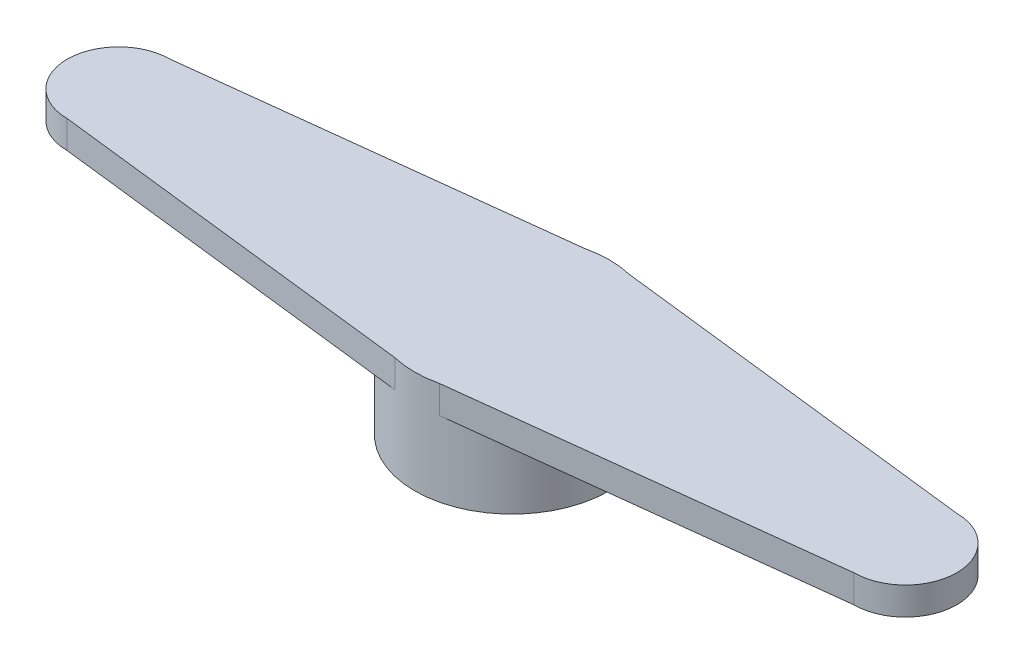
ISO-10303-21;
HEADER;
FILE_DESCRIPTION(('STEP AP214'),'2;1');
FILE_NAME('part.step','',(''),(''),'','','');
FILE_SCHEMA(('AUTOMOTIVE_DESIGN { 1 0 10303 214 1 1 1 1 }'));
ENDSEC;
DATA;
#1=APPLICATION_CONTEXT('core data for automotive mechanical design processes');
#2=APPLICATION_PROTOCOL_DEFINITION('international standard','automotive_design',2000,#1);
#3=PRODUCT_CONTEXT('',#1,'mechanical');
#4=PRODUCT('Part','Part','',(#3));
#5=PRODUCT_RELATED_PRODUCT_CATEGORY('part','',(#4));
#6=PRODUCT_DEFINITION_FORMATION('','',#4);
#7=PRODUCT_DEFINITION_CONTEXT('part definition',#1,'design');
#8=PRODUCT_DEFINITION('design','',#6,#7);
#9=PRODUCT_DEFINITION_SHAPE('','',#8);
#10=(LENGTH_UNIT() NAMED_UNIT(*) SI_UNIT(.MILLI.,.METRE.));
#11=(NAMED_UNIT(*) PLANE_ANGLE_UNIT() SI_UNIT($,.RADIAN.));
#12=(NAMED_UNIT(*) SI_UNIT($,.STERADIAN.) SOLID_ANGLE_UNIT());
#13=UNCERTAINTY_MEASURE_WITH_UNIT(LENGTH_MEASURE(1.E-05),#10,'distance_accuracy_value','');
#14=(GEOMETRIC_REPRESENTATION_CONTEXT(3) GLOBAL_UNCERTAINTY_ASSIGNED_CONTEXT((#13)) GLOBAL_UNIT_ASSIGNED_CONTEXT((#10,
#11,#12)) REPRESENTATION_CONTEXT('',''));
#15=CARTESIAN_POINT('',(0.,0.,0.));
#16=DIRECTION('',(0.,0.,1.));
#17=DIRECTION('',(1.,0.,0.));
#18=AXIS2_PLACEMENT_3D('',#15,#16,#17);
#19=CARTESIAN_POINT('',(0.,3.7,0.));
#20=DIRECTION('',(0.,-1.,0.));
#21=DIRECTION('',(0.,0.,-1.));
#22=AXIS2_PLACEMENT_3D('',#19,#20,#21);
#23=CYLINDRICAL_SURFACE('',#22,2.5);
#24=CARTESIAN_POINT('',(0.,0.,0.));
#25=DIRECTION('',(0.,1.,0.));
#26=DIRECTION('',(0.,0.,1.));
#27=AXIS2_PLACEMENT_3D('',#24,#25,#26);
#28=CIRCLE('',#27,2.5);
#29=CARTESIAN_POINT('',(0.,0.,2.5));
#30=VERTEX_POINT('',#29);
#31=EDGE_CURVE('E157',#30,#30,#28,.T.);
#32=ORIENTED_EDGE('',*,*,#31,.F.);
#33=EDGE_LOOP('',(#32));
#34=FACE_BOUND('',#33,.T.);
#35=CARTESIAN_POINT('',(0.,2.7,0.));
#36=DIRECTION('',(0.,1.,0.));
#37=DIRECTION('',(0.,0.,1.));
#38=AXIS2_PLACEMENT_3D('',#35,#36,#37);
#39=CIRCLE('',#38,2.5);
#40=CARTESIAN_POINT('',(0.,2.7,2.5));
#41=VERTEX_POINT('',#40);
#42=EDGE_CURVE('E150',#41,#41,#39,.T.);
#43=ORIENTED_EDGE('',*,*,#42,.T.);
#44=EDGE_LOOP('',(#43));
#45=FACE_BOUND('',#44,.T.);
#46=ADVANCED_FACE('F35',(#34,#45),#23,.F.);
#47=CARTESIAN_POINT('',(0.,3.7,0.));
#48=DIRECTION('',(0.,1.,0.));
#49=DIRECTION('',(0.,0.,1.));
#50=AXIS2_PLACEMENT_3D('',#47,#48,#49);
#51=PLANE('',#50);
#52=DIRECTION('',(0.993269870354682,0.,0.115822988415917));
#53=VECTOR('',#52,1.);
#54=CARTESIAN_POINT('',(0.,3.7,3.5));
#55=LINE('',#54,#53);
#56=CARTESIAN_POINT('',(-14.15,3.7,1.85));
#57=VERTEX_POINT('',#56);
#58=CARTESIAN_POINT('',(-0.805304392815789,3.7,3.40609524748084));
#59=VERTEX_POINT('',#58);
#60=EDGE_CURVE('E108',#57,#59,#55,.T.);
#61=ORIENTED_EDGE('',*,*,#60,.T.);
#62=CARTESIAN_POINT('',(0.,3.7,0.));
#63=DIRECTION('',(0.,1.,0.));
#64=DIRECTION('',(0.,0.,1.));
#65=AXIS2_PLACEMENT_3D('',#62,#63,#64);
#66=CIRCLE('',#65,3.5);
#67=CARTESIAN_POINT('',(0.805304392815791,3.7,3.40609524748084));
#68=VERTEX_POINT('',#67);
#69=EDGE_CURVE('E50',#59,#68,#66,.T.);
#70=ORIENTED_EDGE('',*,*,#69,.T.);
#71=DIRECTION('',(0.993269870354682,0.,-0.115822988415917));
#72=VECTOR('',#71,1.);
#73=CARTESIAN_POINT('',(14.15,3.7,1.85));
#74=LINE('',#73,#72);
#75=CARTESIAN_POINT('',(14.15,3.7,1.85));
#76=VERTEX_POINT('',#75);
#77=EDGE_CURVE('E144',#68,#76,#74,.T.);
#78=ORIENTED_EDGE('',*,*,#77,.T.);
#79=CARTESIAN_POINT('',(14.15,3.7,0.));
#80=DIRECTION('',(0.,1.,0.));
#81=DIRECTION('',(0.,0.,1.));
#82=AXIS2_PLACEMENT_3D('',#79,#80,#81);
#83=CIRCLE('',#82,1.85);
#84=CARTESIAN_POINT('',(14.15,3.7,-1.85));
#85=VERTEX_POINT('',#84);
#86=EDGE_CURVE('E146',#76,#85,#83,.T.);
#87=ORIENTED_EDGE('',*,*,#86,.T.);
#88=DIRECTION('',(-0.993269870354682,0.,-0.115822988415917));
#89=VECTOR('',#88,1.);
#90=CARTESIAN_POINT('',(0.,3.7,-3.5));
#91=LINE('',#90,#89);
#92=CARTESIAN_POINT('',(0.805304392815789,3.7,-3.40609524748084));
#93=VERTEX_POINT('',#92);
#94=EDGE_CURVE('E58',#85,#93,#91,.T.);
#95=ORIENTED_EDGE('',*,*,#94,.T.);
#96=CARTESIAN_POINT('',(-0.805304392815791,3.7,-3.40609524748084));
#97=VERTEX_POINT('',#96);
#98=EDGE_CURVE('E163',#93,#97,#66,.T.);
#99=ORIENTED_EDGE('',*,*,#98,.T.);
#100=DIRECTION('',(-0.993269870354682,0.,0.115822988415917));
#101=VECTOR('',#100,1.);
#102=CARTESIAN_POINT('',(-14.15,3.7,-1.85));
#103=LINE('',#102,#101);
#104=CARTESIAN_POINT('',(-14.15,3.7,-1.85));
#105=VERTEX_POINT('',#104);
#106=EDGE_CURVE('E129',#97,#105,#103,.T.);
#107=ORIENTED_EDGE('',*,*,#106,.T.);
#108=CARTESIAN_POINT('',(-14.15,3.7,0.));
#109=DIRECTION('',(0.,1.,0.));
#110=DIRECTION('',(0.,0.,1.));
#111=AXIS2_PLACEMENT_3D('',#108,#109,#110);
#112=CIRCLE('',#111,1.85);
#113=EDGE_CURVE('E141',#105,#57,#112,.T.);
#114=ORIENTED_EDGE('',*,*,#113,.T.);
#115=EDGE_LOOP('',(#61,#70,#78,#87,#95,#99,#107,#114));
#116=FACE_BOUND('',#115,.T.);
#117=ADVANCED_FACE('F175',(#116),#51,.T.);
#118=CARTESIAN_POINT('',(0.,0.,0.));
#119=DIRECTION('',(0.,1.,0.));
#120=DIRECTION('',(0.,0.,1.));
#121=AXIS2_PLACEMENT_3D('',#118,#119,#120);
#122=PLANE('',#121);
#123=CARTESIAN_POINT('',(0.,0.,0.));
#124=DIRECTION('',(0.,1.,0.));
#125=DIRECTION('',(0.,0.,1.));
#126=AXIS2_PLACEMENT_3D('',#123,#124,#125);
#127=CIRCLE('',#126,3.5);
#128=CARTESIAN_POINT('',(0.,0.,3.5));
#129=VERTEX_POINT('',#128);
#130=EDGE_CURVE('E160',#129,#129,#127,.T.);
#131=ORIENTED_EDGE('',*,*,#130,.F.);
#132=EDGE_LOOP('',(#131));
#133=FACE_BOUND('',#132,.T.);
#134=ORIENTED_EDGE('',*,*,#31,.T.);
#135=EDGE_LOOP('',(#134));
#136=FACE_BOUND('',#135,.T.);
#137=ADVANCED_FACE('F198',(#133,#136),#122,.F.);
#138=CARTESIAN_POINT('',(0.,3.7,0.));
#139=DIRECTION('',(0.,-1.,0.));
#140=DIRECTION('',(0.,0.,-1.));
#141=AXIS2_PLACEMENT_3D('',#138,#139,#140);
#142=CYLINDRICAL_SURFACE('',#141,3.5);
#143=DIRECTION('',(0.,-1.,0.));
#144=VECTOR('',#143,1.);
#145=CARTESIAN_POINT('',(-0.805304392815791,3.7,-3.40609524748084));
#146=LINE('',#145,#144);
#147=CARTESIAN_POINT('',(-0.805304392815791,2.7,-3.40609524748084));
#148=VERTEX_POINT('',#147);
#149=EDGE_CURVE('E169',#148,#97,#146,.F.);
#150=ORIENTED_EDGE('',*,*,#149,.T.);
#151=ORIENTED_EDGE('',*,*,#98,.F.);
#152=DIRECTION('',(0.,-1.,0.));
#153=VECTOR('',#152,1.);
#154=CARTESIAN_POINT('',(0.805304392815791,3.7,-3.40609524748084));
#155=LINE('',#154,#153);
#156=CARTESIAN_POINT('',(0.805304392815789,2.7,-3.40609524748084));
#157=VERTEX_POINT('',#156);
#158=EDGE_CURVE('E11',#93,#157,#155,.T.);
#159=ORIENTED_EDGE('',*,*,#158,.T.);
#160=CARTESIAN_POINT('',(0.,2.7,0.));
#161=DIRECTION('',(0.,1.,0.));
#162=DIRECTION('',(0.,0.,1.));
#163=AXIS2_PLACEMENT_3D('',#160,#161,#162);
#164=CIRCLE('',#163,3.5);
#165=CARTESIAN_POINT('',(0.805304392815791,2.7,3.40609524748084));
#166=VERTEX_POINT('',#165);
#167=EDGE_CURVE('E156',#166,#157,#164,.T.);
#168=ORIENTED_EDGE('',*,*,#167,.F.);
#169=DIRECTION('',(0.,-1.,0.));
#170=VECTOR('',#169,1.);
#171=CARTESIAN_POINT('',(0.805304392815791,3.7,3.40609524748084));
#172=LINE('',#171,#170);
#173=EDGE_CURVE('E43',#166,#68,#172,.F.);
#174=ORIENTED_EDGE('',*,*,#173,.T.);
#175=ORIENTED_EDGE('',*,*,#69,.F.);
#176=DIRECTION('',(0.,-1.,0.));
#177=VECTOR('',#176,1.);
#178=CARTESIAN_POINT('',(-0.805304392815791,3.7,3.40609524748084));
#179=LINE('',#178,#177);
#180=CARTESIAN_POINT('',(-0.805304392815789,2.7,3.40609524748084));
#181=VERTEX_POINT('',#180);
#182=EDGE_CURVE('E162',#59,#181,#179,.T.);
#183=ORIENTED_EDGE('',*,*,#182,.T.);
#184=EDGE_CURVE('E122',#148,#181,#164,.T.);
#185=ORIENTED_EDGE('',*,*,#184,.F.);
#186=EDGE_LOOP('',(#150,#151,#159,#168,#174,#175,#183,#185));
#187=FACE_BOUND('',#186,.T.);
#188=ORIENTED_EDGE('',*,*,#130,.T.);
#189=EDGE_LOOP('',(#188));
#190=FACE_BOUND('',#189,.T.);
#191=ADVANCED_FACE('F37',(#187,#190),#142,.T.);
#192=CARTESIAN_POINT('',(-14.15,2.7,0.));
#193=DIRECTION('',(0.,1.,0.));
#194=DIRECTION('',(0.,0.,1.));
#195=AXIS2_PLACEMENT_3D('',#192,#193,#194);
#196=PLANE('',#195);
#197=ORIENTED_EDGE('',*,*,#42,.F.);
#198=EDGE_LOOP('',(#197));
#199=FACE_BOUND('',#198,.T.);
#200=ADVANCED_FACE('F208',(#199),#196,.F.);
#201=CARTESIAN_POINT('',(-14.15,2.7,0.));
#202=DIRECTION('',(0.,1.,0.));
#203=DIRECTION('',(0.,0.,1.));
#204=AXIS2_PLACEMENT_3D('',#201,#202,#203);
#205=CYLINDRICAL_SURFACE('',#204,1.85);
#206=ORIENTED_EDGE('',*,*,#113,.F.);
#207=DIRECTION('',(0.,1.,0.));
#208=VECTOR('',#207,1.);
#209=CARTESIAN_POINT('',(-14.15,2.7,-1.85));
#210=LINE('',#209,#208);
#211=CARTESIAN_POINT('',(-14.15,2.7,-1.85));
#212=VERTEX_POINT('',#211);
#213=EDGE_CURVE('E128',#212,#105,#210,.T.);
#214=ORIENTED_EDGE('',*,*,#213,.F.);
#215=CARTESIAN_POINT('',(-14.15,2.7,0.));
#216=DIRECTION('',(0.,1.,0.));
#217=DIRECTION('',(0.,0.,1.));
#218=AXIS2_PLACEMENT_3D('',#215,#216,#217);
#219=CIRCLE('',#218,1.85);
#220=CARTESIAN_POINT('',(-14.15,2.7,1.85));
#221=VERTEX_POINT('',#220);
#222=EDGE_CURVE('E120',#212,#221,#219,.T.);
#223=ORIENTED_EDGE('',*,*,#222,.T.);
#224=DIRECTION('',(0.,1.,0.));
#225=VECTOR('',#224,1.);
#226=CARTESIAN_POINT('',(-14.15,2.7,1.85));
#227=LINE('',#226,#225);
#228=EDGE_CURVE('E103',#221,#57,#227,.T.);
#229=ORIENTED_EDGE('',*,*,#228,.T.);
#230=EDGE_LOOP('',(#206,#214,#223,#229));
#231=FACE_BOUND('',#230,.T.);
#232=ADVANCED_FACE('F126',(#231),#205,.T.);
#233=DIRECTION('',(-0.993269870354682,0.,0.115822988415917));
#234=VECTOR('',#233,1.);
#235=CARTESIAN_POINT('',(-14.15,2.7,-1.85));
#236=LINE('',#235,#234);
#237=EDGE_CURVE('E114',#148,#212,#236,.T.);
#238=ORIENTED_EDGE('',*,*,#237,.F.);
#239=ORIENTED_EDGE('',*,*,#184,.T.);
#240=DIRECTION('',(0.993269870354682,0.,0.115822988415917));
#241=VECTOR('',#240,1.);
#242=CARTESIAN_POINT('',(0.,2.7,3.5));
#243=LINE('',#242,#241);
#244=EDGE_CURVE('E107',#221,#181,#243,.T.);
#245=ORIENTED_EDGE('',*,*,#244,.F.);
#246=ORIENTED_EDGE('',*,*,#222,.F.);
#247=EDGE_LOOP('',(#238,#239,#245,#246));
#248=FACE_BOUND('',#247,.T.);
#249=ADVANCED_FACE('F119',(#248),#196,.F.);
#250=CARTESIAN_POINT('',(0.,2.7,3.5));
#251=DIRECTION('',(-0.115822988415917,0.,0.993269870354682));
#252=DIRECTION('',(0.993269870354682,0.,0.115822988415917));
#253=AXIS2_PLACEMENT_3D('',#250,#251,#252);
#254=PLANE('',#253);
#255=ORIENTED_EDGE('',*,*,#182,.F.);
#256=ORIENTED_EDGE('',*,*,#60,.F.);
#257=ORIENTED_EDGE('',*,*,#228,.F.);
#258=ORIENTED_EDGE('',*,*,#244,.T.);
#259=EDGE_LOOP('',(#255,#256,#257,#258));
#260=FACE_BOUND('',#259,.T.);
#261=ADVANCED_FACE('F106',(#260),#254,.T.);
#262=CARTESIAN_POINT('',(-14.15,2.7,-1.85));
#263=DIRECTION('',(-0.115822988415917,0.,-0.993269870354682));
#264=DIRECTION('',(-0.993269870354682,0.,0.115822988415917));
#265=AXIS2_PLACEMENT_3D('',#262,#263,#264);
#266=PLANE('',#265);
#267=ORIENTED_EDGE('',*,*,#149,.F.);
#268=ORIENTED_EDGE('',*,*,#237,.T.);
#269=ORIENTED_EDGE('',*,*,#213,.T.);
#270=ORIENTED_EDGE('',*,*,#106,.F.);
#271=EDGE_LOOP('',(#267,#268,#269,#270));
#272=FACE_BOUND('',#271,.T.);
#273=ADVANCED_FACE('F179',(#272),#266,.T.);
#274=CARTESIAN_POINT('',(0.,2.7,-3.5));
#275=DIRECTION('',(0.115822988415917,0.,-0.993269870354682));
#276=DIRECTION('',(-0.993269870354682,0.,-0.115822988415917));
#277=AXIS2_PLACEMENT_3D('',#274,#275,#276);
#278=PLANE('',#277);
#279=ORIENTED_EDGE('',*,*,#158,.F.);
#280=ORIENTED_EDGE('',*,*,#94,.F.);
#281=DIRECTION('',(0.,1.,0.));
#282=VECTOR('',#281,1.);
#283=CARTESIAN_POINT('',(14.15,2.7,-1.85));
#284=LINE('',#283,#282);
#285=CARTESIAN_POINT('',(14.15,2.7,-1.85));
#286=VERTEX_POINT('',#285);
#287=EDGE_CURVE('E151',#286,#85,#284,.T.);
#288=ORIENTED_EDGE('',*,*,#287,.F.);
#289=DIRECTION('',(-0.993269870354682,0.,-0.115822988415917));
#290=VECTOR('',#289,1.);
#291=CARTESIAN_POINT('',(0.,2.7,-3.5));
#292=LINE('',#291,#290);
#293=EDGE_CURVE('E137',#286,#157,#292,.T.);
#294=ORIENTED_EDGE('',*,*,#293,.T.);
#295=EDGE_LOOP('',(#279,#280,#288,#294));
#296=FACE_BOUND('',#295,.T.);
#297=ADVANCED_FACE('F181',(#296),#278,.T.);
#298=CARTESIAN_POINT('',(14.15,2.7,1.85));
#299=DIRECTION('',(0.115822988415917,0.,0.993269870354682));
#300=DIRECTION('',(0.993269870354682,0.,-0.115822988415917));
#301=AXIS2_PLACEMENT_3D('',#298,#299,#300);
#302=PLANE('',#301);
#303=ORIENTED_EDGE('',*,*,#173,.F.);
#304=DIRECTION('',(0.993269870354682,0.,-0.115822988415917));
#305=VECTOR('',#304,1.);
#306=CARTESIAN_POINT('',(14.15,2.7,1.85));
#307=LINE('',#306,#305);
#308=CARTESIAN_POINT('',(14.15,2.7,1.85));
#309=VERTEX_POINT('',#308);
#310=EDGE_CURVE('E123',#166,#309,#307,.T.);
#311=ORIENTED_EDGE('',*,*,#310,.T.);
#312=DIRECTION('',(0.,1.,0.));
#313=VECTOR('',#312,1.);
#314=CARTESIAN_POINT('',(14.15,2.7,1.85));
#315=LINE('',#314,#313);
#316=EDGE_CURVE('E113',#309,#76,#315,.T.);
#317=ORIENTED_EDGE('',*,*,#316,.T.);
#318=ORIENTED_EDGE('',*,*,#77,.F.);
#319=EDGE_LOOP('',(#303,#311,#317,#318));
#320=FACE_BOUND('',#319,.T.);
#321=ADVANCED_FACE('F187',(#320),#302,.T.);
#322=ORIENTED_EDGE('',*,*,#310,.F.);
#323=ORIENTED_EDGE('',*,*,#167,.T.);
#324=ORIENTED_EDGE('',*,*,#293,.F.);
#325=CARTESIAN_POINT('',(14.15,2.7,0.));
#326=DIRECTION('',(0.,1.,0.));
#327=DIRECTION('',(0.,0.,1.));
#328=AXIS2_PLACEMENT_3D('',#325,#326,#327);
#329=CIRCLE('',#328,1.85);
#330=EDGE_CURVE('E134',#309,#286,#329,.T.);
#331=ORIENTED_EDGE('',*,*,#330,.F.);
#332=EDGE_LOOP('',(#322,#323,#324,#331));
#333=FACE_BOUND('',#332,.T.);
#334=ADVANCED_FACE('F215',(#333),#196,.F.);
#335=CARTESIAN_POINT('',(14.15,2.7,0.));
#336=DIRECTION('',(0.,1.,0.));
#337=DIRECTION('',(0.,0.,1.));
#338=AXIS2_PLACEMENT_3D('',#335,#336,#337);
#339=CYLINDRICAL_SURFACE('',#338,1.85);
#340=ORIENTED_EDGE('',*,*,#86,.F.);
#341=ORIENTED_EDGE('',*,*,#316,.F.);
#342=ORIENTED_EDGE('',*,*,#330,.T.);
#343=ORIENTED_EDGE('',*,*,#287,.T.);
#344=EDGE_LOOP('',(#340,#341,#342,#343));
#345=FACE_BOUND('',#344,.T.);
#346=ADVANCED_FACE('F222',(#345),#339,.T.);
#347=CLOSED_SHELL('',(#46,#117,#137,#191,#200,#232,#249,#261,#273,#297,#321,#334,#346));
#348=MANIFOLD_SOLID_BREP('B2',#347);
#349=ADVANCED_BREP_SHAPE_REPRESENTATION('',(#18,#348),#14);
#350=SHAPE_DEFINITION_REPRESENTATION(#9,#349);
ENDSEC;
END-ISO-10303-21;
